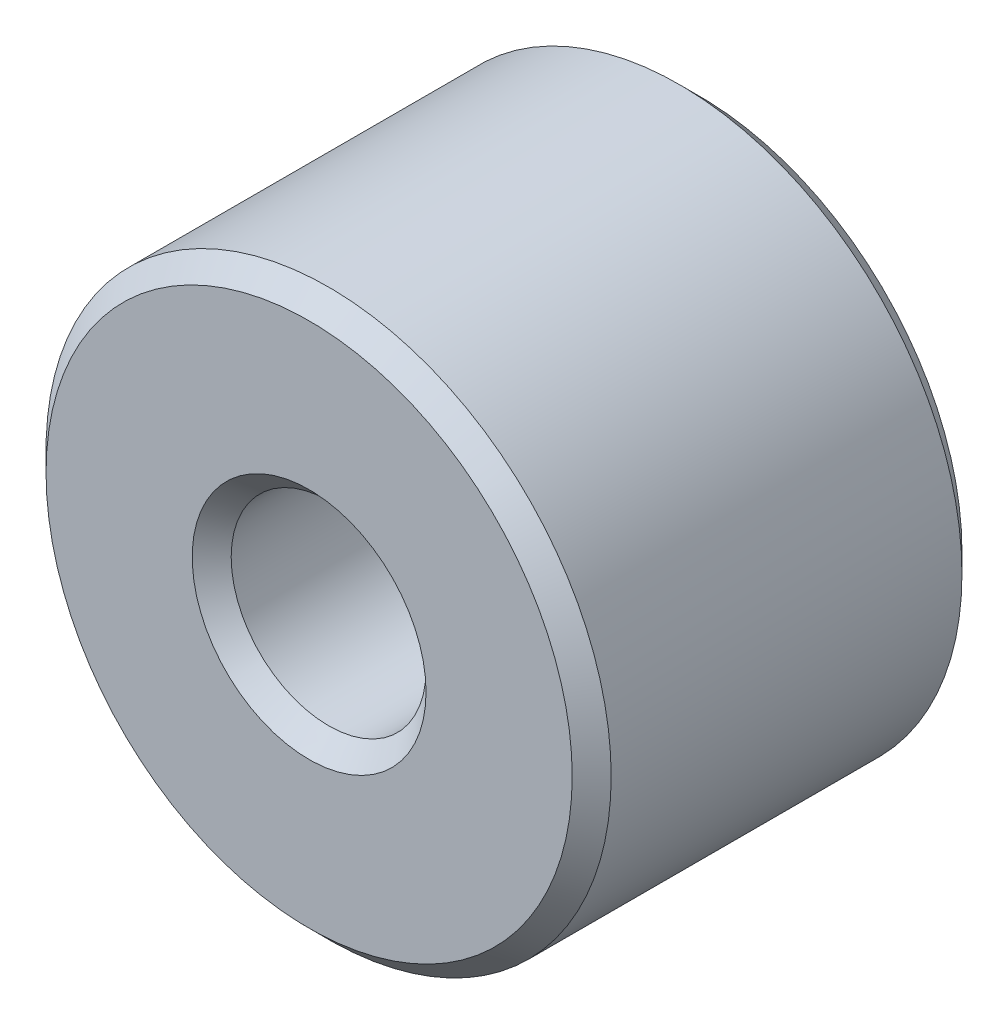
ISO-10303-21;
HEADER;
FILE_DESCRIPTION(('STEP AP214'),'2;1');
FILE_NAME('part.step','',(''),(''),'','','');
FILE_SCHEMA(('AUTOMOTIVE_DESIGN { 1 0 10303 214 1 1 1 1 }'));
ENDSEC;
DATA;
#1=APPLICATION_CONTEXT('core data for automotive mechanical design processes');
#2=APPLICATION_PROTOCOL_DEFINITION('international standard','automotive_design',2000,#1);
#3=PRODUCT_CONTEXT('',#1,'mechanical');
#4=PRODUCT('Part','Part','',(#3));
#5=PRODUCT_RELATED_PRODUCT_CATEGORY('part','',(#4));
#6=PRODUCT_DEFINITION_FORMATION('','',#4);
#7=PRODUCT_DEFINITION_CONTEXT('part definition',#1,'design');
#8=PRODUCT_DEFINITION('design','',#6,#7);
#9=PRODUCT_DEFINITION_SHAPE('','',#8);
#10=(LENGTH_UNIT() NAMED_UNIT(*) SI_UNIT(.MILLI.,.METRE.));
#11=(NAMED_UNIT(*) PLANE_ANGLE_UNIT() SI_UNIT($,.RADIAN.));
#12=(NAMED_UNIT(*) SI_UNIT($,.STERADIAN.) SOLID_ANGLE_UNIT());
#13=UNCERTAINTY_MEASURE_WITH_UNIT(LENGTH_MEASURE(1.E-05),#10,'distance_accuracy_value','');
#14=(GEOMETRIC_REPRESENTATION_CONTEXT(3) GLOBAL_UNCERTAINTY_ASSIGNED_CONTEXT((#13)) GLOBAL_UNIT_ASSIGNED_CONTEXT((#10,
#11,#12)) REPRESENTATION_CONTEXT('',''));
#15=CARTESIAN_POINT('',(0.,0.,0.));
#16=DIRECTION('',(0.,0.,1.));
#17=DIRECTION('',(1.,0.,0.));
#18=AXIS2_PLACEMENT_3D('',#15,#16,#17);
#19=CARTESIAN_POINT('',(0.,0.,10.));
#20=DIRECTION('',(0.,0.,1.));
#21=DIRECTION('',(1.,0.,0.));
#22=AXIS2_PLACEMENT_3D('',#19,#20,#21);
#23=PLANE('',#22);
#24=CARTESIAN_POINT('',(0.,0.,10.));
#25=DIRECTION('',(0.,0.,1.));
#26=DIRECTION('',(1.,0.,0.));
#27=AXIS2_PLACEMENT_3D('',#24,#25,#26);
#28=CIRCLE('',#27,3.);
#29=CARTESIAN_POINT('',(3.,0.,10.));
#30=VERTEX_POINT('',#29);
#31=EDGE_CURVE('E10',#30,#30,#28,.F.);
#32=ORIENTED_EDGE('',*,*,#31,.T.);
#33=EDGE_LOOP('',(#32));
#34=FACE_BOUND('',#33,.T.);
#35=CARTESIAN_POINT('',(0.,0.,10.));
#36=DIRECTION('',(0.,0.,1.));
#37=DIRECTION('',(1.,0.,0.));
#38=AXIS2_PLACEMENT_3D('',#35,#36,#37);
#39=CIRCLE('',#38,6.75);
#40=CARTESIAN_POINT('',(6.75,0.,10.));
#41=VERTEX_POINT('',#40);
#42=EDGE_CURVE('E43',#41,#41,#39,.T.);
#43=ORIENTED_EDGE('',*,*,#42,.T.);
#44=EDGE_LOOP('',(#43));
#45=FACE_BOUND('',#44,.T.);
#46=ADVANCED_FACE('F35',(#34,#45),#23,.T.);
#47=CARTESIAN_POINT('',(0.,0.,0.));
#48=DIRECTION('',(0.,0.,1.));
#49=DIRECTION('',(1.,0.,0.));
#50=AXIS2_PLACEMENT_3D('',#47,#48,#49);
#51=PLANE('',#50);
#52=CARTESIAN_POINT('',(0.,0.,0.));
#53=DIRECTION('',(0.,0.,1.));
#54=DIRECTION('',(1.,0.,0.));
#55=AXIS2_PLACEMENT_3D('',#52,#53,#54);
#56=CIRCLE('',#55,3.);
#57=CARTESIAN_POINT('',(3.,0.,0.));
#58=VERTEX_POINT('',#57);
#59=EDGE_CURVE('E62',#58,#58,#56,.T.);
#60=ORIENTED_EDGE('',*,*,#59,.T.);
#61=EDGE_LOOP('',(#60));
#62=FACE_BOUND('',#61,.T.);
#63=CARTESIAN_POINT('',(0.,0.,0.));
#64=DIRECTION('',(0.,0.,1.));
#65=DIRECTION('',(1.,0.,0.));
#66=AXIS2_PLACEMENT_3D('',#63,#64,#65);
#67=CIRCLE('',#66,6.75);
#68=CARTESIAN_POINT('',(6.75,0.,0.));
#69=VERTEX_POINT('',#68);
#70=EDGE_CURVE('E65',#69,#69,#67,.F.);
#71=ORIENTED_EDGE('',*,*,#70,.T.);
#72=EDGE_LOOP('',(#71));
#73=FACE_BOUND('',#72,.T.);
#74=ADVANCED_FACE('F69',(#62,#73),#51,.F.);
#75=CARTESIAN_POINT('',(0.,0.,10.));
#76=DIRECTION('',(0.,0.,-1.));
#77=DIRECTION('',(-1.,0.,0.));
#78=AXIS2_PLACEMENT_3D('',#75,#76,#77);
#79=CYLINDRICAL_SURFACE('',#78,7.25);
#80=CARTESIAN_POINT('',(0.,0.,0.500000000000002));
#81=DIRECTION('',(0.,0.,1.));
#82=DIRECTION('',(1.,0.,0.));
#83=AXIS2_PLACEMENT_3D('',#80,#81,#82);
#84=CIRCLE('',#83,7.25);
#85=CARTESIAN_POINT('',(7.25,0.,0.500000000000002));
#86=VERTEX_POINT('',#85);
#87=EDGE_CURVE('E47',#86,#86,#84,.T.);
#88=ORIENTED_EDGE('',*,*,#87,.T.);
#89=EDGE_LOOP('',(#88));
#90=FACE_BOUND('',#89,.T.);
#91=CARTESIAN_POINT('',(0.,0.,9.49999999999999));
#92=DIRECTION('',(0.,0.,1.));
#93=DIRECTION('',(1.,0.,0.));
#94=AXIS2_PLACEMENT_3D('',#91,#92,#93);
#95=CIRCLE('',#94,7.25);
#96=CARTESIAN_POINT('',(7.25,0.,9.49999999999999));
#97=VERTEX_POINT('',#96);
#98=EDGE_CURVE('E51',#97,#97,#95,.F.);
#99=ORIENTED_EDGE('',*,*,#98,.T.);
#100=EDGE_LOOP('',(#99));
#101=FACE_BOUND('',#100,.T.);
#102=ADVANCED_FACE('F79',(#90,#101),#79,.T.);
#103=CARTESIAN_POINT('',(0.,0.,10.));
#104=DIRECTION('',(0.,0.,-1.));
#105=DIRECTION('',(-1.,0.,0.));
#106=AXIS2_PLACEMENT_3D('',#103,#104,#105);
#107=CYLINDRICAL_SURFACE('',#106,2.5);
#108=CARTESIAN_POINT('',(0.,0.,0.499999999999999));
#109=DIRECTION('',(0.,0.,1.));
#110=DIRECTION('',(1.,0.,0.));
#111=AXIS2_PLACEMENT_3D('',#108,#109,#110);
#112=CIRCLE('',#111,2.5);
#113=CARTESIAN_POINT('',(2.5,0.,0.499999999999999));
#114=VERTEX_POINT('',#113);
#115=EDGE_CURVE('E56',#114,#114,#112,.F.);
#116=ORIENTED_EDGE('',*,*,#115,.T.);
#117=EDGE_LOOP('',(#116));
#118=FACE_BOUND('',#117,.T.);
#119=CARTESIAN_POINT('',(0.,0.,9.5));
#120=DIRECTION('',(0.,0.,1.));
#121=DIRECTION('',(1.,0.,0.));
#122=AXIS2_PLACEMENT_3D('',#119,#120,#121);
#123=CIRCLE('',#122,2.5);
#124=CARTESIAN_POINT('',(2.5,0.,9.5));
#125=VERTEX_POINT('',#124);
#126=EDGE_CURVE('E59',#125,#125,#123,.T.);
#127=ORIENTED_EDGE('',*,*,#126,.T.);
#128=EDGE_LOOP('',(#127));
#129=FACE_BOUND('',#128,.T.);
#130=ADVANCED_FACE('F82',(#118,#129),#107,.F.);
#131=CARTESIAN_POINT('',(0.,0.,0.));
#132=DIRECTION('',(0.,0.,-1.));
#133=DIRECTION('',(-1.,0.,0.));
#134=AXIS2_PLACEMENT_3D('',#131,#132,#133);
#135=CONICAL_SURFACE('',#134,3.,0.785398163397447);
#136=ORIENTED_EDGE('',*,*,#115,.F.);
#137=EDGE_LOOP('',(#136));
#138=FACE_BOUND('',#137,.T.);
#139=ORIENTED_EDGE('',*,*,#59,.F.);
#140=EDGE_LOOP('',(#139));
#141=FACE_BOUND('',#140,.T.);
#142=ADVANCED_FACE('F75',(#138,#141),#135,.F.);
#143=CARTESIAN_POINT('',(0.,0.,0.500000000000002));
#144=DIRECTION('',(0.,0.,1.));
#145=DIRECTION('',(1.,0.,0.));
#146=AXIS2_PLACEMENT_3D('',#143,#144,#145);
#147=CONICAL_SURFACE('',#146,7.25,0.78539816339745);
#148=ORIENTED_EDGE('',*,*,#70,.F.);
#149=EDGE_LOOP('',(#148));
#150=FACE_BOUND('',#149,.T.);
#151=ORIENTED_EDGE('',*,*,#87,.F.);
#152=EDGE_LOOP('',(#151));
#153=FACE_BOUND('',#152,.T.);
#154=ADVANCED_FACE('F71',(#150,#153),#147,.T.);
#155=CARTESIAN_POINT('',(0.,0.,9.5));
#156=DIRECTION('',(0.,0.,1.));
#157=DIRECTION('',(1.,0.,0.));
#158=AXIS2_PLACEMENT_3D('',#155,#156,#157);
#159=CONICAL_SURFACE('',#158,2.5,0.785398163397451);
#160=ORIENTED_EDGE('',*,*,#31,.F.);
#161=EDGE_LOOP('',(#160));
#162=FACE_BOUND('',#161,.T.);
#163=ORIENTED_EDGE('',*,*,#126,.F.);
#164=EDGE_LOOP('',(#163));
#165=FACE_BOUND('',#164,.T.);
#166=ADVANCED_FACE('F74',(#162,#165),#159,.F.);
#167=CARTESIAN_POINT('',(0.,0.,10.));
#168=DIRECTION('',(0.,0.,-1.));
#169=DIRECTION('',(-1.,0.,0.));
#170=AXIS2_PLACEMENT_3D('',#167,#168,#169);
#171=CONICAL_SURFACE('',#170,6.75,0.785398163397444);
#172=ORIENTED_EDGE('',*,*,#98,.F.);
#173=EDGE_LOOP('',(#172));
#174=FACE_BOUND('',#173,.T.);
#175=ORIENTED_EDGE('',*,*,#42,.F.);
#176=EDGE_LOOP('',(#175));
#177=FACE_BOUND('',#176,.T.);
#178=ADVANCED_FACE('F38',(#174,#177),#171,.T.);
#179=CLOSED_SHELL('',(#46,#74,#102,#130,#142,#154,#166,#178));
#180=MANIFOLD_SOLID_BREP('B2',#179);
#181=ADVANCED_BREP_SHAPE_REPRESENTATION('',(#18,#180),#14);
#182=SHAPE_DEFINITION_REPRESENTATION(#9,#181);
ENDSEC;
END-ISO-10303-21;
